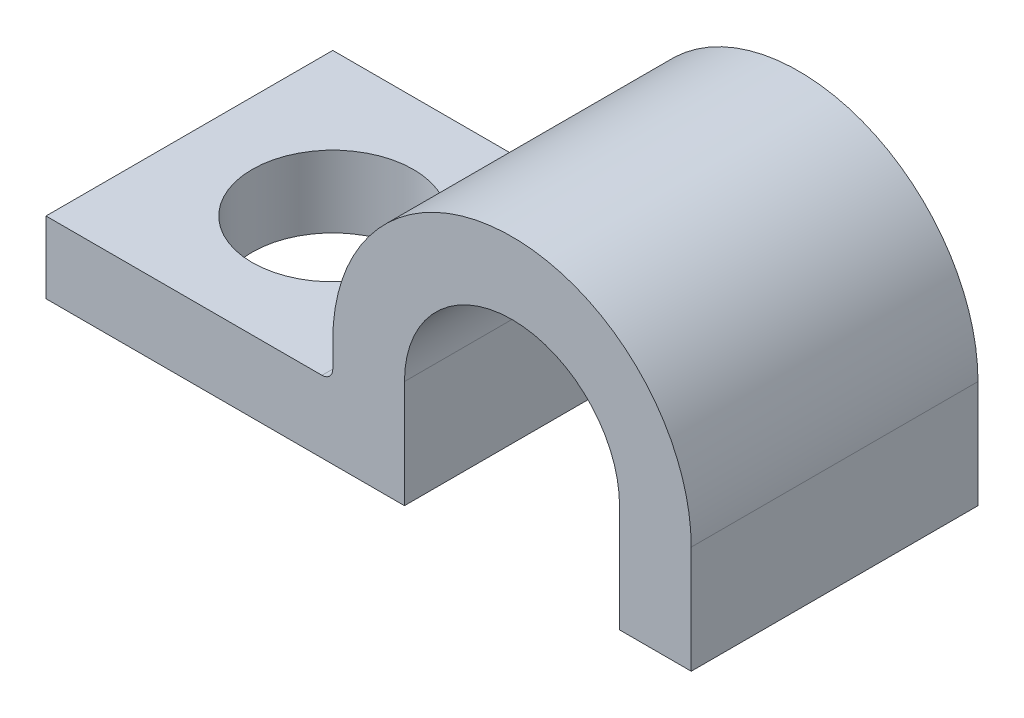
ISO-10303-21;
HEADER;
FILE_DESCRIPTION(('STEP AP214'),'2;1');
FILE_NAME('part.step','',(''),(''),'','','');
FILE_SCHEMA(('AUTOMOTIVE_DESIGN { 1 0 10303 214 1 1 1 1 }'));
ENDSEC;
DATA;
#1=APPLICATION_CONTEXT('core data for automotive mechanical design processes');
#2=APPLICATION_PROTOCOL_DEFINITION('international standard','automotive_design',2000,#1);
#3=PRODUCT_CONTEXT('',#1,'mechanical');
#4=PRODUCT('Part','Part','',(#3));
#5=PRODUCT_RELATED_PRODUCT_CATEGORY('part','',(#4));
#6=PRODUCT_DEFINITION_FORMATION('','',#4);
#7=PRODUCT_DEFINITION_CONTEXT('part definition',#1,'design');
#8=PRODUCT_DEFINITION('design','',#6,#7);
#9=PRODUCT_DEFINITION_SHAPE('','',#8);
#10=(LENGTH_UNIT() NAMED_UNIT(*) SI_UNIT(.MILLI.,.METRE.));
#11=(NAMED_UNIT(*) PLANE_ANGLE_UNIT() SI_UNIT($,.RADIAN.));
#12=(NAMED_UNIT(*) SI_UNIT($,.STERADIAN.) SOLID_ANGLE_UNIT());
#13=UNCERTAINTY_MEASURE_WITH_UNIT(LENGTH_MEASURE(1.E-05),#10,'distance_accuracy_value','');
#14=(GEOMETRIC_REPRESENTATION_CONTEXT(3) GLOBAL_UNCERTAINTY_ASSIGNED_CONTEXT((#13)) GLOBAL_UNIT_ASSIGNED_CONTEXT((#10,
#11,#12)) REPRESENTATION_CONTEXT('',''));
#15=CARTESIAN_POINT('',(0.,0.,0.));
#16=DIRECTION('',(0.,0.,1.));
#17=DIRECTION('',(1.,0.,0.));
#18=AXIS2_PLACEMENT_3D('',#15,#16,#17);
#19=CARTESIAN_POINT('',(0.,0.,7.99999999999995));
#20=DIRECTION('',(1.,0.,0.));
#21=DIRECTION('',(0.,0.,-1.));
#22=AXIS2_PLACEMENT_3D('',#19,#20,#21);
#23=PLANE('',#22);
#24=DIRECTION('',(0.,-1.,0.));
#25=VECTOR('',#24,1.);
#26=CARTESIAN_POINT('',(0.,0.,0.));
#27=LINE('',#26,#25);
#28=CARTESIAN_POINT('',(0.,1.99999999999989,0.));
#29=VERTEX_POINT('',#28);
#30=CARTESIAN_POINT('',(0.,0.,0.));
#31=VERTEX_POINT('',#30);
#32=EDGE_CURVE('E117',#29,#31,#27,.T.);
#33=ORIENTED_EDGE('',*,*,#32,.T.);
#34=DIRECTION('',(0.,0.,-1.));
#35=VECTOR('',#34,1.);
#36=CARTESIAN_POINT('',(0.,0.,7.99999999999995));
#37=LINE('',#36,#35);
#38=CARTESIAN_POINT('',(0.,0.,7.99999999999995));
#39=VERTEX_POINT('',#38);
#40=EDGE_CURVE('E125',#39,#31,#37,.T.);
#41=ORIENTED_EDGE('',*,*,#40,.F.);
#42=DIRECTION('',(0.,-1.,0.));
#43=VECTOR('',#42,1.);
#44=CARTESIAN_POINT('',(0.,0.,7.99999999999995));
#45=LINE('',#44,#43);
#46=CARTESIAN_POINT('',(0.,1.9999999999999,7.99999999999995));
#47=VERTEX_POINT('',#46);
#48=EDGE_CURVE('E159',#47,#39,#45,.T.);
#49=ORIENTED_EDGE('',*,*,#48,.F.);
#50=DIRECTION('',(0.,0.,-1.));
#51=VECTOR('',#50,1.);
#52=CARTESIAN_POINT('',(0.,1.9999999999999,7.99999999999995));
#53=LINE('',#52,#51);
#54=EDGE_CURVE('E136',#47,#29,#53,.T.);
#55=ORIENTED_EDGE('',*,*,#54,.T.);
#56=EDGE_LOOP('',(#33,#41,#49,#55));
#57=FACE_BOUND('',#56,.T.);
#58=ADVANCED_FACE('F32',(#57),#23,.F.);
#59=CARTESIAN_POINT('',(0.,0.,7.99999999999995));
#60=DIRECTION('',(0.,1.,0.));
#61=DIRECTION('',(-1.,0.,0.));
#62=AXIS2_PLACEMENT_3D('',#59,#60,#61);
#63=PLANE('',#62);
#64=CARTESIAN_POINT('',(4.00000000000001,0.,4.));
#65=DIRECTION('',(0.,1.,0.));
#66=DIRECTION('',(-1.,0.,0.));
#67=AXIS2_PLACEMENT_3D('',#64,#65,#66);
#68=CIRCLE('',#67,2.25);
#69=CARTESIAN_POINT('',(1.75000000000001,0.,4.));
#70=VERTEX_POINT('',#69);
#71=EDGE_CURVE('E137',#70,#70,#68,.T.);
#72=ORIENTED_EDGE('',*,*,#71,.T.);
#73=EDGE_LOOP('',(#72));
#74=FACE_BOUND('',#73,.T.);
#75=DIRECTION('',(1.,0.,0.));
#76=VECTOR('',#75,1.);
#77=CARTESIAN_POINT('',(0.,0.,0.));
#78=LINE('',#77,#76);
#79=CARTESIAN_POINT('',(10.,0.,0.));
#80=VERTEX_POINT('',#79);
#81=EDGE_CURVE('E113',#31,#80,#78,.T.);
#82=ORIENTED_EDGE('',*,*,#81,.T.);
#83=DIRECTION('',(0.,0.,-1.));
#84=VECTOR('',#83,1.);
#85=CARTESIAN_POINT('',(9.99999999999998,0.,8.00000000000006));
#86=LINE('',#85,#84);
#87=CARTESIAN_POINT('',(9.99999999999998,0.,8.00000000000006));
#88=VERTEX_POINT('',#87);
#89=EDGE_CURVE('E132',#88,#80,#86,.T.);
#90=ORIENTED_EDGE('',*,*,#89,.F.);
#91=DIRECTION('',(1.,0.,0.));
#92=VECTOR('',#91,1.);
#93=CARTESIAN_POINT('',(0.,0.,7.99999999999995));
#94=LINE('',#93,#92);
#95=EDGE_CURVE('E127',#39,#88,#94,.T.);
#96=ORIENTED_EDGE('',*,*,#95,.F.);
#97=ORIENTED_EDGE('',*,*,#40,.T.);
#98=EDGE_LOOP('',(#82,#90,#96,#97));
#99=FACE_BOUND('',#98,.T.);
#100=ADVANCED_FACE('F126',(#74,#99),#63,.F.);
#101=CARTESIAN_POINT('',(9.99999999999998,0.,8.00000000000006));
#102=DIRECTION('',(-1.,0.,0.));
#103=DIRECTION('',(0.,-1.,0.));
#104=AXIS2_PLACEMENT_3D('',#101,#102,#103);
#105=PLANE('',#104);
#106=DIRECTION('',(0.,1.,0.));
#107=VECTOR('',#106,1.);
#108=CARTESIAN_POINT('',(10.,0.,0.));
#109=LINE('',#108,#107);
#110=CARTESIAN_POINT('',(10.,2.99999999999992,0.));
#111=VERTEX_POINT('',#110);
#112=EDGE_CURVE('E119',#80,#111,#109,.T.);
#113=ORIENTED_EDGE('',*,*,#112,.T.);
#114=DIRECTION('',(0.,0.,-1.));
#115=VECTOR('',#114,1.);
#116=CARTESIAN_POINT('',(10.,2.99999999999992,7.99999999999998));
#117=LINE('',#116,#115);
#118=CARTESIAN_POINT('',(10.,2.99999999999992,7.99999999999998));
#119=VERTEX_POINT('',#118);
#120=EDGE_CURVE('E194',#119,#111,#117,.T.);
#121=ORIENTED_EDGE('',*,*,#120,.F.);
#122=DIRECTION('',(0.,1.,0.));
#123=VECTOR('',#122,1.);
#124=CARTESIAN_POINT('',(9.99999999999998,0.,8.00000000000006));
#125=LINE('',#124,#123);
#126=EDGE_CURVE('E162',#88,#119,#125,.T.);
#127=ORIENTED_EDGE('',*,*,#126,.F.);
#128=ORIENTED_EDGE('',*,*,#89,.T.);
#129=EDGE_LOOP('',(#113,#121,#127,#128));
#130=FACE_BOUND('',#129,.T.);
#131=ADVANCED_FACE('F237',(#130),#105,.F.);
#132=CARTESIAN_POINT('',(13.,2.99999999999992,8.00000000000009));
#133=DIRECTION('',(0.,0.,-1.));
#134=DIRECTION('',(-1.,0.,0.));
#135=AXIS2_PLACEMENT_3D('',#132,#133,#134);
#136=CYLINDRICAL_SURFACE('',#135,3.);
#137=CARTESIAN_POINT('',(13.,2.99999999999998,0.));
#138=DIRECTION('',(0.,0.,-1.));
#139=DIRECTION('',(-1.,0.,0.));
#140=AXIS2_PLACEMENT_3D('',#137,#138,#139);
#141=CIRCLE('',#140,3.);
#142=CARTESIAN_POINT('',(16.,2.99999999999992,0.));
#143=VERTEX_POINT('',#142);
#144=EDGE_CURVE('E145',#111,#143,#141,.T.);
#145=ORIENTED_EDGE('',*,*,#144,.T.);
#146=DIRECTION('',(0.,0.,-1.));
#147=VECTOR('',#146,1.);
#148=CARTESIAN_POINT('',(16.,2.99999999999992,8.00000000000002));
#149=LINE('',#148,#147);
#150=CARTESIAN_POINT('',(16.,2.99999999999992,8.00000000000002));
#151=VERTEX_POINT('',#150);
#152=EDGE_CURVE('E191',#151,#143,#149,.T.);
#153=ORIENTED_EDGE('',*,*,#152,.F.);
#154=CARTESIAN_POINT('',(13.,2.99999999999992,8.00000000000009));
#155=DIRECTION('',(0.,0.,-1.));
#156=DIRECTION('',(-1.,0.,0.));
#157=AXIS2_PLACEMENT_3D('',#154,#155,#156);
#158=CIRCLE('',#157,3.);
#159=EDGE_CURVE('E164',#119,#151,#158,.T.);
#160=ORIENTED_EDGE('',*,*,#159,.F.);
#161=ORIENTED_EDGE('',*,*,#120,.T.);
#162=EDGE_LOOP('',(#145,#153,#160,#161));
#163=FACE_BOUND('',#162,.T.);
#164=ADVANCED_FACE('F233',(#163),#136,.F.);
#165=CARTESIAN_POINT('',(16.,2.99999999999992,8.00000000000002));
#166=DIRECTION('',(1.,0.,0.));
#167=DIRECTION('',(0.,0.,-1.));
#168=AXIS2_PLACEMENT_3D('',#165,#166,#167);
#169=PLANE('',#168);
#170=DIRECTION('',(0.,-1.,0.));
#171=VECTOR('',#170,1.);
#172=CARTESIAN_POINT('',(16.,2.99999999999992,0.));
#173=LINE('',#172,#171);
#174=CARTESIAN_POINT('',(16.,-1.2490009027033E-13,0.));
#175=VERTEX_POINT('',#174);
#176=EDGE_CURVE('E147',#143,#175,#173,.T.);
#177=ORIENTED_EDGE('',*,*,#176,.T.);
#178=DIRECTION('',(0.,0.,-1.));
#179=VECTOR('',#178,1.);
#180=CARTESIAN_POINT('',(16.,-1.2490009027033E-13,8.00000000000005));
#181=LINE('',#180,#179);
#182=CARTESIAN_POINT('',(16.,-1.2490009027033E-13,8.00000000000005));
#183=VERTEX_POINT('',#182);
#184=EDGE_CURVE('E188',#183,#175,#181,.T.);
#185=ORIENTED_EDGE('',*,*,#184,.F.);
#186=DIRECTION('',(0.,-1.,0.));
#187=VECTOR('',#186,1.);
#188=CARTESIAN_POINT('',(16.,2.99999999999992,8.00000000000002));
#189=LINE('',#188,#187);
#190=EDGE_CURVE('E166',#151,#183,#189,.T.);
#191=ORIENTED_EDGE('',*,*,#190,.F.);
#192=ORIENTED_EDGE('',*,*,#152,.T.);
#193=EDGE_LOOP('',(#177,#185,#191,#192));
#194=FACE_BOUND('',#193,.T.);
#195=ADVANCED_FACE('F228',(#194),#169,.F.);
#196=CARTESIAN_POINT('',(18.,0.,8.00000000000006));
#197=DIRECTION('',(0.,1.,0.));
#198=DIRECTION('',(-1.,0.,0.));
#199=AXIS2_PLACEMENT_3D('',#196,#197,#198);
#200=PLANE('',#199);
#201=DIRECTION('',(1.,0.,0.));
#202=VECTOR('',#201,1.);
#203=CARTESIAN_POINT('',(18.,0.,0.));
#204=LINE('',#203,#202);
#205=CARTESIAN_POINT('',(18.,0.,0.));
#206=VERTEX_POINT('',#205);
#207=EDGE_CURVE('E149',#175,#206,#204,.T.);
#208=ORIENTED_EDGE('',*,*,#207,.T.);
#209=DIRECTION('',(0.,0.,-1.));
#210=VECTOR('',#209,1.);
#211=CARTESIAN_POINT('',(18.,0.,8.00000000000006));
#212=LINE('',#211,#210);
#213=CARTESIAN_POINT('',(18.,0.,8.00000000000006));
#214=VERTEX_POINT('',#213);
#215=EDGE_CURVE('E185',#214,#206,#212,.T.);
#216=ORIENTED_EDGE('',*,*,#215,.F.);
#217=DIRECTION('',(1.,0.,0.));
#218=VECTOR('',#217,1.);
#219=CARTESIAN_POINT('',(18.,0.,8.00000000000006));
#220=LINE('',#219,#218);
#221=EDGE_CURVE('E168',#183,#214,#220,.T.);
#222=ORIENTED_EDGE('',*,*,#221,.F.);
#223=ORIENTED_EDGE('',*,*,#184,.T.);
#224=EDGE_LOOP('',(#208,#216,#222,#223));
#225=FACE_BOUND('',#224,.T.);
#226=ADVANCED_FACE('F224',(#225),#200,.F.);
#227=CARTESIAN_POINT('',(18.,2.99999999999995,7.99999999999999));
#228=DIRECTION('',(-1.,0.,0.));
#229=DIRECTION('',(0.,-1.,0.));
#230=AXIS2_PLACEMENT_3D('',#227,#228,#229);
#231=PLANE('',#230);
#232=DIRECTION('',(0.,1.,0.));
#233=VECTOR('',#232,1.);
#234=CARTESIAN_POINT('',(18.0000000000001,2.99999999999998,0.));
#235=LINE('',#234,#233);
#236=CARTESIAN_POINT('',(18.0000000000001,2.99999999999998,0.));
#237=VERTEX_POINT('',#236);
#238=EDGE_CURVE('E151',#206,#237,#235,.T.);
#239=ORIENTED_EDGE('',*,*,#238,.T.);
#240=DIRECTION('',(0.,0.,-1.));
#241=VECTOR('',#240,1.);
#242=CARTESIAN_POINT('',(18.,2.99999999999995,7.99999999999999));
#243=LINE('',#242,#241);
#244=CARTESIAN_POINT('',(18.,2.99999999999995,7.99999999999999));
#245=VERTEX_POINT('',#244);
#246=EDGE_CURVE('E182',#245,#237,#243,.T.);
#247=ORIENTED_EDGE('',*,*,#246,.F.);
#248=DIRECTION('',(0.,1.,0.));
#249=VECTOR('',#248,1.);
#250=CARTESIAN_POINT('',(18.,2.99999999999995,7.99999999999999));
#251=LINE('',#250,#249);
#252=EDGE_CURVE('E170',#214,#245,#251,.T.);
#253=ORIENTED_EDGE('',*,*,#252,.F.);
#254=ORIENTED_EDGE('',*,*,#215,.T.);
#255=EDGE_LOOP('',(#239,#247,#253,#254));
#256=FACE_BOUND('',#255,.T.);
#257=ADVANCED_FACE('F220',(#256),#231,.F.);
#258=CARTESIAN_POINT('',(13.,2.99999999999992,8.00000000000009));
#259=DIRECTION('',(0.,0.,-1.));
#260=DIRECTION('',(-1.,0.,0.));
#261=AXIS2_PLACEMENT_3D('',#258,#259,#260);
#262=CYLINDRICAL_SURFACE('',#261,5.);
#263=CARTESIAN_POINT('',(13.,2.99999999999998,0.));
#264=DIRECTION('',(0.,0.,1.));
#265=DIRECTION('',(-1.,0.,0.));
#266=AXIS2_PLACEMENT_3D('',#263,#264,#265);
#267=CIRCLE('',#266,5.);
#268=CARTESIAN_POINT('',(8.,2.99999999999999,0.));
#269=VERTEX_POINT('',#268);
#270=EDGE_CURVE('E153',#237,#269,#267,.T.);
#271=ORIENTED_EDGE('',*,*,#270,.T.);
#272=DIRECTION('',(0.,0.,-1.));
#273=VECTOR('',#272,1.);
#274=CARTESIAN_POINT('',(8.00000000000003,2.99999999999999,7.99999999999995));
#275=LINE('',#274,#273);
#276=CARTESIAN_POINT('',(8.00000000000003,2.99999999999999,7.99999999999995));
#277=VERTEX_POINT('',#276);
#278=EDGE_CURVE('E179',#277,#269,#275,.T.);
#279=ORIENTED_EDGE('',*,*,#278,.F.);
#280=CARTESIAN_POINT('',(13.,2.99999999999992,8.00000000000009));
#281=DIRECTION('',(0.,0.,1.));
#282=DIRECTION('',(-1.,0.,0.));
#283=AXIS2_PLACEMENT_3D('',#280,#281,#282);
#284=CIRCLE('',#283,5.);
#285=EDGE_CURVE('E172',#245,#277,#284,.T.);
#286=ORIENTED_EDGE('',*,*,#285,.F.);
#287=ORIENTED_EDGE('',*,*,#246,.T.);
#288=EDGE_LOOP('',(#271,#279,#286,#287));
#289=FACE_BOUND('',#288,.T.);
#290=ADVANCED_FACE('F216',(#289),#262,.T.);
#291=CARTESIAN_POINT('',(8.00000000000004,1.99999999999996,7.99999999999998));
#292=DIRECTION('',(1.,0.,0.));
#293=DIRECTION('',(0.,1.,0.));
#294=AXIS2_PLACEMENT_3D('',#291,#292,#293);
#295=PLANE('',#294);
#296=DIRECTION('',(0.,-1.,0.));
#297=VECTOR('',#296,1.);
#298=CARTESIAN_POINT('',(8.00000000000004,1.99999999999997,0.));
#299=LINE('',#298,#297);
#300=CARTESIAN_POINT('',(8.00000000000004,2.2999999999999,0.));
#301=VERTEX_POINT('',#300);
#302=EDGE_CURVE('E155',#269,#301,#299,.T.);
#303=ORIENTED_EDGE('',*,*,#302,.T.);
#304=DIRECTION('',(0.,0.,-1.));
#305=VECTOR('',#304,1.);
#306=CARTESIAN_POINT('',(8.00000000000004,2.29999999999989,7.99999999999998));
#307=LINE('',#306,#305);
#308=CARTESIAN_POINT('',(8.00000000000004,2.29999999999989,7.99999999999998));
#309=VERTEX_POINT('',#308);
#310=EDGE_CURVE('E46',#301,#309,#307,.F.);
#311=ORIENTED_EDGE('',*,*,#310,.T.);
#312=DIRECTION('',(0.,-1.,0.));
#313=VECTOR('',#312,1.);
#314=CARTESIAN_POINT('',(8.00000000000004,1.99999999999996,7.99999999999998));
#315=LINE('',#314,#313);
#316=EDGE_CURVE('E174',#277,#309,#315,.T.);
#317=ORIENTED_EDGE('',*,*,#316,.F.);
#318=ORIENTED_EDGE('',*,*,#278,.T.);
#319=EDGE_LOOP('',(#303,#311,#317,#318));
#320=FACE_BOUND('',#319,.T.);
#321=ADVANCED_FACE('F211',(#320),#295,.F.);
#322=CARTESIAN_POINT('',(0.,1.9999999999999,7.99999999999995));
#323=DIRECTION('',(0.,-1.,0.));
#324=DIRECTION('',(1.,0.,0.));
#325=AXIS2_PLACEMENT_3D('',#322,#323,#324);
#326=PLANE('',#325);
#327=CARTESIAN_POINT('',(4.00000000000002,1.99999999999992,3.99999999999996));
#328=DIRECTION('',(0.,1.,0.));
#329=DIRECTION('',(-1.,0.,0.));
#330=AXIS2_PLACEMENT_3D('',#327,#328,#329);
#331=CIRCLE('',#330,2.25);
#332=CARTESIAN_POINT('',(1.75000000000002,1.99999999999992,3.99999999999996));
#333=VERTEX_POINT('',#332);
#334=EDGE_CURVE('E140',#333,#333,#331,.T.);
#335=ORIENTED_EDGE('',*,*,#334,.F.);
#336=EDGE_LOOP('',(#335));
#337=FACE_BOUND('',#336,.T.);
#338=DIRECTION('',(-1.,0.,0.));
#339=VECTOR('',#338,1.);
#340=CARTESIAN_POINT('',(0.,1.9999999999999,7.99999999999995));
#341=LINE('',#340,#339);
#342=CARTESIAN_POINT('',(7.7,1.99999999999992,7.99999999999998));
#343=VERTEX_POINT('',#342);
#344=EDGE_CURVE('E176',#343,#47,#341,.T.);
#345=ORIENTED_EDGE('',*,*,#344,.F.);
#346=DIRECTION('',(0.,0.,-1.));
#347=VECTOR('',#346,1.);
#348=CARTESIAN_POINT('',(7.7,2.,0.));
#349=LINE('',#348,#347);
#350=CARTESIAN_POINT('',(7.7,2.,0.));
#351=VERTEX_POINT('',#350);
#352=EDGE_CURVE('E131',#343,#351,#349,.T.);
#353=ORIENTED_EDGE('',*,*,#352,.T.);
#354=DIRECTION('',(-1.,0.,0.));
#355=VECTOR('',#354,1.);
#356=CARTESIAN_POINT('',(0.,1.99999999999989,0.));
#357=LINE('',#356,#355);
#358=EDGE_CURVE('E157',#351,#29,#357,.T.);
#359=ORIENTED_EDGE('',*,*,#358,.T.);
#360=ORIENTED_EDGE('',*,*,#54,.F.);
#361=EDGE_LOOP('',(#345,#353,#359,#360));
#362=FACE_BOUND('',#361,.T.);
#363=ADVANCED_FACE('F203',(#337,#362),#326,.F.);
#364=CARTESIAN_POINT('',(13.,2.99999999999992,8.00000000000009));
#365=DIRECTION('',(0.,0.,-1.));
#366=DIRECTION('',(-1.,0.,0.));
#367=AXIS2_PLACEMENT_3D('',#364,#365,#366);
#368=PLANE('',#367);
#369=ORIENTED_EDGE('',*,*,#48,.T.);
#370=ORIENTED_EDGE('',*,*,#95,.T.);
#371=ORIENTED_EDGE('',*,*,#126,.T.);
#372=ORIENTED_EDGE('',*,*,#159,.T.);
#373=ORIENTED_EDGE('',*,*,#190,.T.);
#374=ORIENTED_EDGE('',*,*,#221,.T.);
#375=ORIENTED_EDGE('',*,*,#252,.T.);
#376=ORIENTED_EDGE('',*,*,#285,.T.);
#377=ORIENTED_EDGE('',*,*,#316,.T.);
#378=CARTESIAN_POINT('',(7.7,2.29999999999991,8.00000000000001));
#379=DIRECTION('',(0.,0.,-1.));
#380=DIRECTION('',(-1.,0.,0.));
#381=AXIS2_PLACEMENT_3D('',#378,#379,#380);
#382=CIRCLE('',#381,0.3);
#383=EDGE_CURVE('E11',#309,#343,#382,.T.);
#384=ORIENTED_EDGE('',*,*,#383,.T.);
#385=ORIENTED_EDGE('',*,*,#344,.T.);
#386=EDGE_LOOP('',(#369,#370,#371,#372,#373,#374,#375,#376,#377,#384,#385));
#387=FACE_BOUND('',#386,.T.);
#388=ADVANCED_FACE('F208',(#387),#368,.F.);
#389=CARTESIAN_POINT('',(13.,2.99999999999998,0.));
#390=DIRECTION('',(0.,0.,-1.));
#391=DIRECTION('',(-1.,0.,0.));
#392=AXIS2_PLACEMENT_3D('',#389,#390,#391);
#393=PLANE('',#392);
#394=ORIENTED_EDGE('',*,*,#32,.F.);
#395=ORIENTED_EDGE('',*,*,#358,.F.);
#396=CARTESIAN_POINT('',(7.70000000000001,2.29999999999991,0.));
#397=DIRECTION('',(0.,0.,-1.));
#398=DIRECTION('',(-1.,0.,0.));
#399=AXIS2_PLACEMENT_3D('',#396,#397,#398);
#400=CIRCLE('',#399,0.3);
#401=EDGE_CURVE('E39',#351,#301,#400,.F.);
#402=ORIENTED_EDGE('',*,*,#401,.T.);
#403=ORIENTED_EDGE('',*,*,#302,.F.);
#404=ORIENTED_EDGE('',*,*,#270,.F.);
#405=ORIENTED_EDGE('',*,*,#238,.F.);
#406=ORIENTED_EDGE('',*,*,#207,.F.);
#407=ORIENTED_EDGE('',*,*,#176,.F.);
#408=ORIENTED_EDGE('',*,*,#144,.F.);
#409=ORIENTED_EDGE('',*,*,#112,.F.);
#410=ORIENTED_EDGE('',*,*,#81,.F.);
#411=EDGE_LOOP('',(#394,#395,#402,#403,#404,#405,#406,#407,#408,#409,#410));
#412=FACE_BOUND('',#411,.T.);
#413=ADVANCED_FACE('F115',(#412),#393,.T.);
#414=CARTESIAN_POINT('',(4.00000000000001,0.,4.));
#415=DIRECTION('',(0.,1.,0.));
#416=DIRECTION('',(-1.,0.,0.));
#417=AXIS2_PLACEMENT_3D('',#414,#415,#416);
#418=CYLINDRICAL_SURFACE('',#417,2.25);
#419=ORIENTED_EDGE('',*,*,#71,.F.);
#420=EDGE_LOOP('',(#419));
#421=FACE_BOUND('',#420,.T.);
#422=ORIENTED_EDGE('',*,*,#334,.T.);
#423=EDGE_LOOP('',(#422));
#424=FACE_BOUND('',#423,.T.);
#425=ADVANCED_FACE('F329',(#421,#424),#418,.F.);
#426=CARTESIAN_POINT('',(7.7,2.29999999999991,8.00000000000001));
#427=DIRECTION('',(0.,0.,1.));
#428=DIRECTION('',(1.,0.,0.));
#429=AXIS2_PLACEMENT_3D('',#426,#427,#428);
#430=CYLINDRICAL_SURFACE('',#429,0.3);
#431=ORIENTED_EDGE('',*,*,#383,.F.);
#432=ORIENTED_EDGE('',*,*,#310,.F.);
#433=ORIENTED_EDGE('',*,*,#401,.F.);
#434=ORIENTED_EDGE('',*,*,#352,.F.);
#435=EDGE_LOOP('',(#431,#432,#433,#434));
#436=FACE_BOUND('',#435,.T.);
#437=ADVANCED_FACE('F206',(#436),#430,.F.);
#438=CLOSED_SHELL('',(#58,#100,#131,#164,#195,#226,#257,#290,#321,#363,#388,#413,#425,#437));
#439=MANIFOLD_SOLID_BREP('B2',#438);
#440=ADVANCED_BREP_SHAPE_REPRESENTATION('',(#18,#439),#14);
#441=SHAPE_DEFINITION_REPRESENTATION(#9,#440);
ENDSEC;
END-ISO-10303-21;
